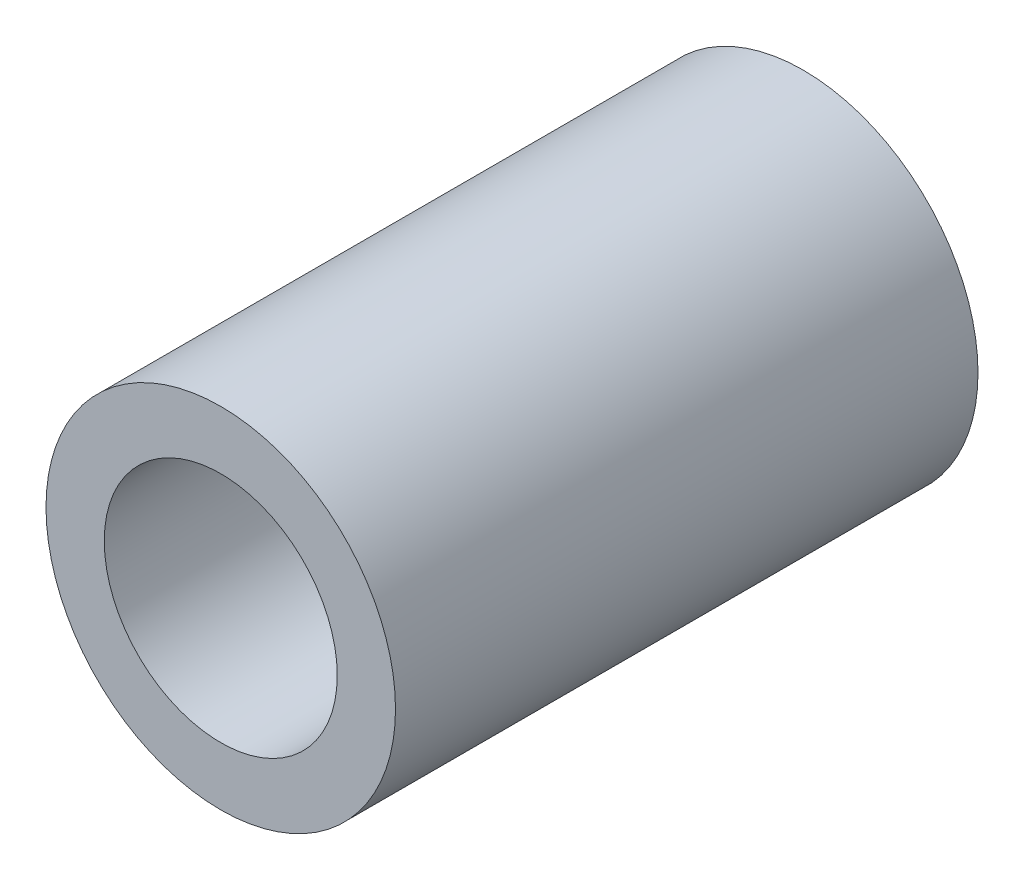
ISO-10303-21;
HEADER;
FILE_DESCRIPTION(('STEP AP214'),'2;1');
FILE_NAME('part.step','',(''),(''),'','','');
FILE_SCHEMA(('AUTOMOTIVE_DESIGN { 1 0 10303 214 1 1 1 1 }'));
ENDSEC;
DATA;
#1=APPLICATION_CONTEXT('core data for automotive mechanical design processes');
#2=APPLICATION_PROTOCOL_DEFINITION('international standard','automotive_design',2000,#1);
#3=PRODUCT_CONTEXT('',#1,'mechanical');
#4=PRODUCT('Part','Part','',(#3));
#5=PRODUCT_RELATED_PRODUCT_CATEGORY('part','',(#4));
#6=PRODUCT_DEFINITION_FORMATION('','',#4);
#7=PRODUCT_DEFINITION_CONTEXT('part definition',#1,'design');
#8=PRODUCT_DEFINITION('design','',#6,#7);
#9=PRODUCT_DEFINITION_SHAPE('','',#8);
#10=(LENGTH_UNIT() NAMED_UNIT(*) SI_UNIT(.MILLI.,.METRE.));
#11=(NAMED_UNIT(*) PLANE_ANGLE_UNIT() SI_UNIT($,.RADIAN.));
#12=(NAMED_UNIT(*) SI_UNIT($,.STERADIAN.) SOLID_ANGLE_UNIT());
#13=UNCERTAINTY_MEASURE_WITH_UNIT(LENGTH_MEASURE(1.E-05),#10,'distance_accuracy_value','');
#14=(GEOMETRIC_REPRESENTATION_CONTEXT(3) GLOBAL_UNCERTAINTY_ASSIGNED_CONTEXT((#13)) GLOBAL_UNIT_ASSIGNED_CONTEXT((#10,
#11,#12)) REPRESENTATION_CONTEXT('',''));
#15=CARTESIAN_POINT('',(0.,0.,0.));
#16=DIRECTION('',(0.,0.,1.));
#17=DIRECTION('',(1.,0.,0.));
#18=AXIS2_PLACEMENT_3D('',#15,#16,#17);
#19=CARTESIAN_POINT('',(0.,0.,20.));
#20=DIRECTION('',(0.,0.,1.));
#21=DIRECTION('',(1.,0.,0.));
#22=AXIS2_PLACEMENT_3D('',#19,#20,#21);
#23=PLANE('',#22);
#24=CARTESIAN_POINT('',(0.,0.,20.));
#25=DIRECTION('',(0.,0.,1.));
#26=DIRECTION('',(1.,0.,0.));
#27=AXIS2_PLACEMENT_3D('',#24,#25,#26);
#28=CIRCLE('',#27,6.);
#29=CARTESIAN_POINT('',(6.,0.,20.));
#30=VERTEX_POINT('',#29);
#31=EDGE_CURVE('E10',#30,#30,#28,.T.);
#32=ORIENTED_EDGE('',*,*,#31,.T.);
#33=EDGE_LOOP('',(#32));
#34=FACE_BOUND('',#33,.T.);
#35=CARTESIAN_POINT('',(0.,0.,20.));
#36=DIRECTION('',(0.,0.,1.));
#37=DIRECTION('',(1.,0.,0.));
#38=AXIS2_PLACEMENT_3D('',#35,#36,#37);
#39=CIRCLE('',#38,4.);
#40=CARTESIAN_POINT('',(4.,0.,20.));
#41=VERTEX_POINT('',#40);
#42=EDGE_CURVE('E41',#41,#41,#39,.T.);
#43=ORIENTED_EDGE('',*,*,#42,.F.);
#44=EDGE_LOOP('',(#43));
#45=FACE_BOUND('',#44,.T.);
#46=ADVANCED_FACE('F30',(#34,#45),#23,.T.);
#47=CARTESIAN_POINT('',(0.,0.,0.));
#48=DIRECTION('',(0.,0.,1.));
#49=DIRECTION('',(1.,0.,0.));
#50=AXIS2_PLACEMENT_3D('',#47,#48,#49);
#51=PLANE('',#50);
#52=CARTESIAN_POINT('',(0.,0.,0.));
#53=DIRECTION('',(0.,0.,1.));
#54=DIRECTION('',(1.,0.,0.));
#55=AXIS2_PLACEMENT_3D('',#52,#53,#54);
#56=CIRCLE('',#55,6.);
#57=CARTESIAN_POINT('',(6.,0.,0.));
#58=VERTEX_POINT('',#57);
#59=EDGE_CURVE('E34',#58,#58,#56,.T.);
#60=ORIENTED_EDGE('',*,*,#59,.F.);
#61=EDGE_LOOP('',(#60));
#62=FACE_BOUND('',#61,.T.);
#63=CARTESIAN_POINT('',(0.,0.,0.));
#64=DIRECTION('',(0.,0.,1.));
#65=DIRECTION('',(1.,0.,0.));
#66=AXIS2_PLACEMENT_3D('',#63,#64,#65);
#67=CIRCLE('',#66,4.);
#68=CARTESIAN_POINT('',(4.,0.,0.));
#69=VERTEX_POINT('',#68);
#70=EDGE_CURVE('E43',#69,#69,#67,.T.);
#71=ORIENTED_EDGE('',*,*,#70,.T.);
#72=EDGE_LOOP('',(#71));
#73=FACE_BOUND('',#72,.T.);
#74=ADVANCED_FACE('F53',(#62,#73),#51,.F.);
#75=CARTESIAN_POINT('',(0.,0.,20.));
#76=DIRECTION('',(0.,0.,-1.));
#77=DIRECTION('',(-1.,0.,0.));
#78=AXIS2_PLACEMENT_3D('',#75,#76,#77);
#79=CYLINDRICAL_SURFACE('',#78,6.);
#80=ORIENTED_EDGE('',*,*,#31,.F.);
#81=EDGE_LOOP('',(#80));
#82=FACE_BOUND('',#81,.T.);
#83=ORIENTED_EDGE('',*,*,#59,.T.);
#84=EDGE_LOOP('',(#83));
#85=FACE_BOUND('',#84,.T.);
#86=ADVANCED_FACE('F32',(#82,#85),#79,.T.);
#87=CARTESIAN_POINT('',(0.,0.,20.));
#88=DIRECTION('',(0.,0.,-1.));
#89=DIRECTION('',(-1.,0.,0.));
#90=AXIS2_PLACEMENT_3D('',#87,#88,#89);
#91=CYLINDRICAL_SURFACE('',#90,4.);
#92=ORIENTED_EDGE('',*,*,#42,.T.);
#93=EDGE_LOOP('',(#92));
#94=FACE_BOUND('',#93,.T.);
#95=ORIENTED_EDGE('',*,*,#70,.F.);
#96=EDGE_LOOP('',(#95));
#97=FACE_BOUND('',#96,.T.);
#98=ADVANCED_FACE('F49',(#94,#97),#91,.F.);
#99=CLOSED_SHELL('',(#46,#74,#86,#98));
#100=MANIFOLD_SOLID_BREP('B2',#99);
#101=ADVANCED_BREP_SHAPE_REPRESENTATION('',(#18,#100),#14);
#102=SHAPE_DEFINITION_REPRESENTATION(#9,#101);
ENDSEC;
END-ISO-10303-21;
